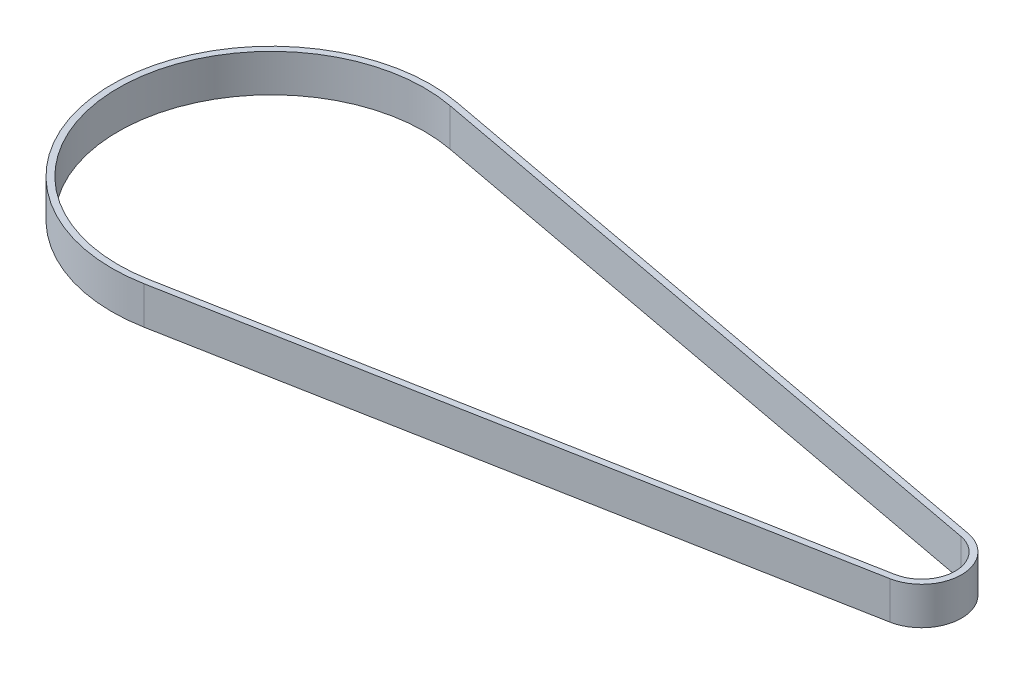
ISO-10303-21;
HEADER;
FILE_DESCRIPTION(('STEP AP214'),'2;1');
FILE_NAME('part.step','',(''),(''),'','','');
FILE_SCHEMA(('AUTOMOTIVE_DESIGN { 1 0 10303 214 1 1 1 1 }'));
ENDSEC;
DATA;
#1=APPLICATION_CONTEXT('core data for automotive mechanical design processes');
#2=APPLICATION_PROTOCOL_DEFINITION('international standard','automotive_design',2000,#1);
#3=PRODUCT_CONTEXT('',#1,'mechanical');
#4=PRODUCT('Part','Part','',(#3));
#5=PRODUCT_RELATED_PRODUCT_CATEGORY('part','',(#4));
#6=PRODUCT_DEFINITION_FORMATION('','',#4);
#7=PRODUCT_DEFINITION_CONTEXT('part definition',#1,'design');
#8=PRODUCT_DEFINITION('design','',#6,#7);
#9=PRODUCT_DEFINITION_SHAPE('','',#8);
#10=(LENGTH_UNIT() NAMED_UNIT(*) SI_UNIT(.MILLI.,.METRE.));
#11=(NAMED_UNIT(*) PLANE_ANGLE_UNIT() SI_UNIT($,.RADIAN.));
#12=(NAMED_UNIT(*) SI_UNIT($,.STERADIAN.) SOLID_ANGLE_UNIT());
#13=UNCERTAINTY_MEASURE_WITH_UNIT(LENGTH_MEASURE(1.E-05),#10,'distance_accuracy_value','');
#14=(GEOMETRIC_REPRESENTATION_CONTEXT(3) GLOBAL_UNCERTAINTY_ASSIGNED_CONTEXT((#13)) GLOBAL_UNIT_ASSIGNED_CONTEXT((#10,
#11,#12)) REPRESENTATION_CONTEXT('',''));
#15=CARTESIAN_POINT('',(0.,0.,0.));
#16=DIRECTION('',(0.,0.,1.));
#17=DIRECTION('',(1.,0.,0.));
#18=AXIS2_PLACEMENT_3D('',#15,#16,#17);
#19=CARTESIAN_POINT('',(0.,6.,0.));
#20=DIRECTION('',(0.,1.,0.));
#21=DIRECTION('',(0.,0.,1.));
#22=AXIS2_PLACEMENT_3D('',#19,#20,#21);
#23=PLANE('',#22);
#24=CARTESIAN_POINT('',(0.,6.,0.));
#25=DIRECTION('',(0.,1.,0.));
#26=DIRECTION('',(0.,0.,1.));
#27=AXIS2_PLACEMENT_3D('',#24,#25,#26);
#28=CIRCLE('',#27,25.4);
#29=CARTESIAN_POINT('',(4.66982060754861,6.,-24.9670337744257));
#30=VERTEX_POINT('',#29);
#31=CARTESIAN_POINT('',(4.66982060754861,6.,24.9670337744257));
#32=VERTEX_POINT('',#31);
#33=EDGE_CURVE('E135',#30,#32,#28,.T.);
#34=ORIENTED_EDGE('',*,*,#33,.T.);
#35=DIRECTION('',(0.982954085607312,0.,-0.183851205021599));
#36=VECTOR('',#35,1.);
#37=CARTESIAN_POINT('',(4.66982060754861,6.,24.9670337744257));
#38=LINE('',#37,#36);
#39=CARTESIAN_POINT('',(104.783855151887,6.,6.24175844360643));
#40=VERTEX_POINT('',#39);
#41=EDGE_CURVE('E138',#32,#40,#38,.T.);
#42=ORIENTED_EDGE('',*,*,#41,.T.);
#43=CARTESIAN_POINT('',(103.6164,6.,0.));
#44=DIRECTION('',(0.,1.,0.));
#45=DIRECTION('',(0.,0.,1.));
#46=AXIS2_PLACEMENT_3D('',#43,#44,#45);
#47=CIRCLE('',#46,6.35);
#48=CARTESIAN_POINT('',(104.783855151887,6.,-6.24175844360643));
#49=VERTEX_POINT('',#48);
#50=EDGE_CURVE('E141',#40,#49,#47,.T.);
#51=ORIENTED_EDGE('',*,*,#50,.T.);
#52=DIRECTION('',(-0.982954085607312,0.,-0.183851205021599));
#53=VECTOR('',#52,1.);
#54=CARTESIAN_POINT('',(4.66982060754861,6.,-24.9670337744257));
#55=LINE('',#54,#53);
#56=EDGE_CURVE('E143',#49,#30,#55,.T.);
#57=ORIENTED_EDGE('',*,*,#56,.T.);
#58=EDGE_LOOP('',(#34,#42,#51,#57));
#59=FACE_BOUND('',#58,.T.);
#60=DIRECTION('',(0.982954085607312,0.,-0.183851205021599));
#61=VECTOR('',#60,1.);
#62=CARTESIAN_POINT('',(4.48596940252701,6.,23.9840796888184));
#63=LINE('',#62,#61);
#64=CARTESIAN_POINT('',(4.48596940252701,6.,23.9840796888184));
#65=VERTEX_POINT('',#64);
#66=CARTESIAN_POINT('',(104.600003946866,6.,5.25880435799911));
#67=VERTEX_POINT('',#66);
#68=EDGE_CURVE('E107',#65,#67,#63,.T.);
#69=ORIENTED_EDGE('',*,*,#68,.F.);
#70=CARTESIAN_POINT('',(0.,6.,0.));
#71=DIRECTION('',(0.,1.,0.));
#72=DIRECTION('',(0.,0.,1.));
#73=AXIS2_PLACEMENT_3D('',#70,#71,#72);
#74=CIRCLE('',#73,24.4);
#75=CARTESIAN_POINT('',(4.48596940252701,6.,-23.9840796888184));
#76=VERTEX_POINT('',#75);
#77=EDGE_CURVE('E99',#76,#65,#74,.T.);
#78=ORIENTED_EDGE('',*,*,#77,.F.);
#79=DIRECTION('',(-0.982954085607312,0.,-0.183851205021599));
#80=VECTOR('',#79,1.);
#81=CARTESIAN_POINT('',(4.48596940252701,6.,-23.9840796888184));
#82=LINE('',#81,#80);
#83=CARTESIAN_POINT('',(104.600003946866,6.,-5.25880435799911));
#84=VERTEX_POINT('',#83);
#85=EDGE_CURVE('E121',#84,#76,#82,.T.);
#86=ORIENTED_EDGE('',*,*,#85,.F.);
#87=CARTESIAN_POINT('',(103.6164,6.,0.));
#88=DIRECTION('',(0.,1.,0.));
#89=DIRECTION('',(0.,0.,1.));
#90=AXIS2_PLACEMENT_3D('',#87,#88,#89);
#91=CIRCLE('',#90,5.34999999999999);
#92=EDGE_CURVE('E119',#67,#84,#91,.T.);
#93=ORIENTED_EDGE('',*,*,#92,.F.);
#94=EDGE_LOOP('',(#69,#78,#86,#93));
#95=FACE_BOUND('',#94,.T.);
#96=ADVANCED_FACE('F34',(#59,#95),#23,.T.);
#97=CARTESIAN_POINT('',(0.,0.,0.));
#98=DIRECTION('',(0.,1.,0.));
#99=DIRECTION('',(0.,0.,1.));
#100=AXIS2_PLACEMENT_3D('',#97,#98,#99);
#101=PLANE('',#100);
#102=CARTESIAN_POINT('',(0.,0.,0.));
#103=DIRECTION('',(0.,1.,0.));
#104=DIRECTION('',(0.,0.,1.));
#105=AXIS2_PLACEMENT_3D('',#102,#103,#104);
#106=CIRCLE('',#105,25.4);
#107=CARTESIAN_POINT('',(4.66982060754861,0.,-24.9670337744257));
#108=VERTEX_POINT('',#107);
#109=CARTESIAN_POINT('',(4.66982060754861,0.,24.9670337744257));
#110=VERTEX_POINT('',#109);
#111=EDGE_CURVE('E115',#108,#110,#106,.T.);
#112=ORIENTED_EDGE('',*,*,#111,.F.);
#113=DIRECTION('',(-0.982954085607312,0.,-0.183851205021599));
#114=VECTOR('',#113,1.);
#115=CARTESIAN_POINT('',(4.66982060754861,0.,-24.9670337744257));
#116=LINE('',#115,#114);
#117=CARTESIAN_POINT('',(104.783855151887,0.,-6.24175844360643));
#118=VERTEX_POINT('',#117);
#119=EDGE_CURVE('E139',#118,#108,#116,.T.);
#120=ORIENTED_EDGE('',*,*,#119,.F.);
#121=CARTESIAN_POINT('',(103.6164,0.,0.));
#122=DIRECTION('',(0.,1.,0.));
#123=DIRECTION('',(0.,0.,1.));
#124=AXIS2_PLACEMENT_3D('',#121,#122,#123);
#125=CIRCLE('',#124,6.35);
#126=CARTESIAN_POINT('',(104.783855151887,0.,6.24175844360643));
#127=VERTEX_POINT('',#126);
#128=EDGE_CURVE('E150',#127,#118,#125,.T.);
#129=ORIENTED_EDGE('',*,*,#128,.F.);
#130=DIRECTION('',(0.982954085607312,0.,-0.183851205021599));
#131=VECTOR('',#130,1.);
#132=CARTESIAN_POINT('',(4.66982060754861,0.,24.9670337744257));
#133=LINE('',#132,#131);
#134=EDGE_CURVE('E148',#110,#127,#133,.T.);
#135=ORIENTED_EDGE('',*,*,#134,.F.);
#136=EDGE_LOOP('',(#112,#120,#129,#135));
#137=FACE_BOUND('',#136,.T.);
#138=CARTESIAN_POINT('',(0.,0.,0.));
#139=DIRECTION('',(0.,1.,0.));
#140=DIRECTION('',(0.,0.,1.));
#141=AXIS2_PLACEMENT_3D('',#138,#139,#140);
#142=CIRCLE('',#141,24.4);
#143=CARTESIAN_POINT('',(4.48596940252701,0.,-23.9840796888184));
#144=VERTEX_POINT('',#143);
#145=CARTESIAN_POINT('',(4.48596940252701,0.,23.9840796888184));
#146=VERTEX_POINT('',#145);
#147=EDGE_CURVE('E57',#144,#146,#142,.T.);
#148=ORIENTED_EDGE('',*,*,#147,.T.);
#149=DIRECTION('',(0.982954085607312,0.,-0.183851205021599));
#150=VECTOR('',#149,1.);
#151=CARTESIAN_POINT('',(4.48596940252701,0.,23.9840796888184));
#152=LINE('',#151,#150);
#153=CARTESIAN_POINT('',(104.600003946866,0.,5.25880435799911));
#154=VERTEX_POINT('',#153);
#155=EDGE_CURVE('E114',#146,#154,#152,.T.);
#156=ORIENTED_EDGE('',*,*,#155,.T.);
#157=CARTESIAN_POINT('',(103.6164,0.,0.));
#158=DIRECTION('',(0.,1.,0.));
#159=DIRECTION('',(0.,0.,1.));
#160=AXIS2_PLACEMENT_3D('',#157,#158,#159);
#161=CIRCLE('',#160,5.34999999999999);
#162=CARTESIAN_POINT('',(104.600003946866,0.,-5.25880435799911));
#163=VERTEX_POINT('',#162);
#164=EDGE_CURVE('E127',#154,#163,#161,.T.);
#165=ORIENTED_EDGE('',*,*,#164,.T.);
#166=DIRECTION('',(-0.982954085607312,0.,-0.183851205021599));
#167=VECTOR('',#166,1.);
#168=CARTESIAN_POINT('',(4.48596940252701,0.,-23.9840796888184));
#169=LINE('',#168,#167);
#170=EDGE_CURVE('E108',#163,#144,#169,.T.);
#171=ORIENTED_EDGE('',*,*,#170,.T.);
#172=EDGE_LOOP('',(#148,#156,#165,#171));
#173=FACE_BOUND('',#172,.T.);
#174=ADVANCED_FACE('F168',(#137,#173),#101,.F.);
#175=CARTESIAN_POINT('',(0.,6.,0.));
#176=DIRECTION('',(0.,-1.,0.));
#177=DIRECTION('',(0.,0.,-1.));
#178=AXIS2_PLACEMENT_3D('',#175,#176,#177);
#179=CYLINDRICAL_SURFACE('',#178,25.4);
#180=ORIENTED_EDGE('',*,*,#111,.T.);
#181=DIRECTION('',(0.,-1.,0.));
#182=VECTOR('',#181,1.);
#183=CARTESIAN_POINT('',(4.66982060754861,6.,24.9670337744257));
#184=LINE('',#183,#182);
#185=EDGE_CURVE('E11',#32,#110,#184,.T.);
#186=ORIENTED_EDGE('',*,*,#185,.F.);
#187=ORIENTED_EDGE('',*,*,#33,.F.);
#188=DIRECTION('',(0.,-1.,0.));
#189=VECTOR('',#188,1.);
#190=CARTESIAN_POINT('',(4.66982060754861,6.,-24.9670337744257));
#191=LINE('',#190,#189);
#192=EDGE_CURVE('E145',#30,#108,#191,.T.);
#193=ORIENTED_EDGE('',*,*,#192,.T.);
#194=EDGE_LOOP('',(#180,#186,#187,#193));
#195=FACE_BOUND('',#194,.T.);
#196=ADVANCED_FACE('F36',(#195),#179,.T.);
#197=CARTESIAN_POINT('',(4.66982060754861,6.,24.9670337744257));
#198=DIRECTION('',(-0.183851205021599,0.,-0.982954085607312));
#199=DIRECTION('',(-0.982954085607312,0.,0.183851205021599));
#200=AXIS2_PLACEMENT_3D('',#197,#198,#199);
#201=PLANE('',#200);
#202=ORIENTED_EDGE('',*,*,#134,.T.);
#203=DIRECTION('',(0.,-1.,0.));
#204=VECTOR('',#203,1.);
#205=CARTESIAN_POINT('',(104.783855151887,6.,6.24175844360643));
#206=LINE('',#205,#204);
#207=EDGE_CURVE('E42',#40,#127,#206,.T.);
#208=ORIENTED_EDGE('',*,*,#207,.F.);
#209=ORIENTED_EDGE('',*,*,#41,.F.);
#210=ORIENTED_EDGE('',*,*,#185,.T.);
#211=EDGE_LOOP('',(#202,#208,#209,#210));
#212=FACE_BOUND('',#211,.T.);
#213=ADVANCED_FACE('F178',(#212),#201,.F.);
#214=CARTESIAN_POINT('',(103.6164,6.,0.));
#215=DIRECTION('',(0.,-1.,0.));
#216=DIRECTION('',(0.,0.,-1.));
#217=AXIS2_PLACEMENT_3D('',#214,#215,#216);
#218=CYLINDRICAL_SURFACE('',#217,6.35);
#219=ORIENTED_EDGE('',*,*,#128,.T.);
#220=DIRECTION('',(0.,-1.,0.));
#221=VECTOR('',#220,1.);
#222=CARTESIAN_POINT('',(104.783855151887,6.,-6.24175844360643));
#223=LINE('',#222,#221);
#224=EDGE_CURVE('E155',#49,#118,#223,.T.);
#225=ORIENTED_EDGE('',*,*,#224,.F.);
#226=ORIENTED_EDGE('',*,*,#50,.F.);
#227=ORIENTED_EDGE('',*,*,#207,.T.);
#228=EDGE_LOOP('',(#219,#225,#226,#227));
#229=FACE_BOUND('',#228,.T.);
#230=ADVANCED_FACE('F162',(#229),#218,.T.);
#231=CARTESIAN_POINT('',(4.66982060754861,6.,-24.9670337744257));
#232=DIRECTION('',(-0.183851205021599,0.,0.982954085607312));
#233=DIRECTION('',(0.982954085607312,0.,0.183851205021599));
#234=AXIS2_PLACEMENT_3D('',#231,#232,#233);
#235=PLANE('',#234);
#236=ORIENTED_EDGE('',*,*,#119,.T.);
#237=ORIENTED_EDGE('',*,*,#192,.F.);
#238=ORIENTED_EDGE('',*,*,#56,.F.);
#239=ORIENTED_EDGE('',*,*,#224,.T.);
#240=EDGE_LOOP('',(#236,#237,#238,#239));
#241=FACE_BOUND('',#240,.T.);
#242=ADVANCED_FACE('F172',(#241),#235,.F.);
#243=CARTESIAN_POINT('',(0.,6.,0.));
#244=DIRECTION('',(0.,-1.,0.));
#245=DIRECTION('',(0.,0.,-1.));
#246=AXIS2_PLACEMENT_3D('',#243,#244,#245);
#247=CYLINDRICAL_SURFACE('',#246,24.4);
#248=ORIENTED_EDGE('',*,*,#147,.F.);
#249=DIRECTION('',(0.,-1.,0.));
#250=VECTOR('',#249,1.);
#251=CARTESIAN_POINT('',(4.48596940252701,6.,-23.9840796888184));
#252=LINE('',#251,#250);
#253=EDGE_CURVE('E103',#76,#144,#252,.T.);
#254=ORIENTED_EDGE('',*,*,#253,.F.);
#255=ORIENTED_EDGE('',*,*,#77,.T.);
#256=DIRECTION('',(0.,-1.,0.));
#257=VECTOR('',#256,1.);
#258=CARTESIAN_POINT('',(4.48596940252701,6.,23.9840796888184));
#259=LINE('',#258,#257);
#260=EDGE_CURVE('E102',#65,#146,#259,.T.);
#261=ORIENTED_EDGE('',*,*,#260,.T.);
#262=EDGE_LOOP('',(#248,#254,#255,#261));
#263=FACE_BOUND('',#262,.T.);
#264=ADVANCED_FACE('F101',(#263),#247,.F.);
#265=CARTESIAN_POINT('',(4.48596940252701,6.,23.9840796888184));
#266=DIRECTION('',(-0.183851205021599,0.,-0.982954085607312));
#267=DIRECTION('',(-0.982954085607312,0.,0.183851205021599));
#268=AXIS2_PLACEMENT_3D('',#265,#266,#267);
#269=PLANE('',#268);
#270=ORIENTED_EDGE('',*,*,#155,.F.);
#271=ORIENTED_EDGE('',*,*,#260,.F.);
#272=ORIENTED_EDGE('',*,*,#68,.T.);
#273=DIRECTION('',(0.,-1.,0.));
#274=VECTOR('',#273,1.);
#275=CARTESIAN_POINT('',(104.600003946866,6.,5.25880435799911));
#276=LINE('',#275,#274);
#277=EDGE_CURVE('E116',#67,#154,#276,.T.);
#278=ORIENTED_EDGE('',*,*,#277,.T.);
#279=EDGE_LOOP('',(#270,#271,#272,#278));
#280=FACE_BOUND('',#279,.T.);
#281=ADVANCED_FACE('F111',(#280),#269,.T.);
#282=CARTESIAN_POINT('',(103.6164,6.,0.));
#283=DIRECTION('',(0.,-1.,0.));
#284=DIRECTION('',(0.,0.,-1.));
#285=AXIS2_PLACEMENT_3D('',#282,#283,#284);
#286=CYLINDRICAL_SURFACE('',#285,5.34999999999999);
#287=ORIENTED_EDGE('',*,*,#164,.F.);
#288=ORIENTED_EDGE('',*,*,#277,.F.);
#289=ORIENTED_EDGE('',*,*,#92,.T.);
#290=DIRECTION('',(0.,-1.,0.));
#291=VECTOR('',#290,1.);
#292=CARTESIAN_POINT('',(104.600003946866,6.,-5.25880435799911));
#293=LINE('',#292,#291);
#294=EDGE_CURVE('E49',#84,#163,#293,.T.);
#295=ORIENTED_EDGE('',*,*,#294,.T.);
#296=EDGE_LOOP('',(#287,#288,#289,#295));
#297=FACE_BOUND('',#296,.T.);
#298=ADVANCED_FACE('F201',(#297),#286,.F.);
#299=CARTESIAN_POINT('',(4.48596940252701,6.,-23.9840796888184));
#300=DIRECTION('',(-0.183851205021599,0.,0.982954085607312));
#301=DIRECTION('',(0.982954085607312,0.,0.183851205021599));
#302=AXIS2_PLACEMENT_3D('',#299,#300,#301);
#303=PLANE('',#302);
#304=ORIENTED_EDGE('',*,*,#170,.F.);
#305=ORIENTED_EDGE('',*,*,#294,.F.);
#306=ORIENTED_EDGE('',*,*,#85,.T.);
#307=ORIENTED_EDGE('',*,*,#253,.T.);
#308=EDGE_LOOP('',(#304,#305,#306,#307));
#309=FACE_BOUND('',#308,.T.);
#310=ADVANCED_FACE('F205',(#309),#303,.T.);
#311=CLOSED_SHELL('',(#96,#174,#196,#213,#230,#242,#264,#281,#298,#310));
#312=MANIFOLD_SOLID_BREP('B2',#311);
#313=ADVANCED_BREP_SHAPE_REPRESENTATION('',(#18,#312),#14);
#314=SHAPE_DEFINITION_REPRESENTATION(#9,#313);
ENDSEC;
END-ISO-10303-21;
